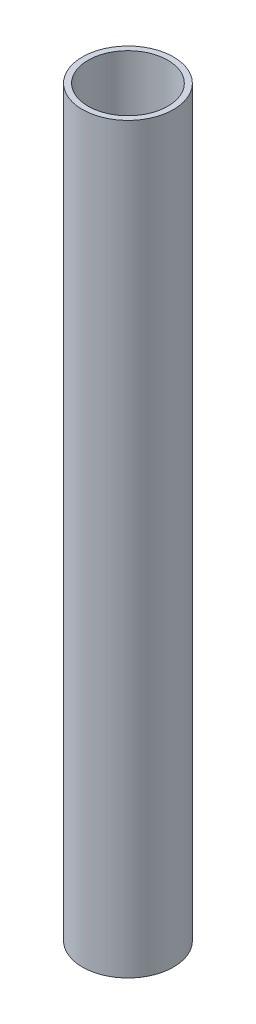
ISO-10303-21;
HEADER;
FILE_DESCRIPTION(('STEP AP214'),'2;1');
FILE_NAME('part.step','',(''),(''),'','','');
FILE_SCHEMA(('AUTOMOTIVE_DESIGN { 1 0 10303 214 1 1 1 1 }'));
ENDSEC;
DATA;
#1=APPLICATION_CONTEXT('core data for automotive mechanical design processes');
#2=APPLICATION_PROTOCOL_DEFINITION('international standard','automotive_design',2000,#1);
#3=PRODUCT_CONTEXT('',#1,'mechanical');
#4=PRODUCT('Part','Part','',(#3));
#5=PRODUCT_RELATED_PRODUCT_CATEGORY('part','',(#4));
#6=PRODUCT_DEFINITION_FORMATION('','',#4);
#7=PRODUCT_DEFINITION_CONTEXT('part definition',#1,'design');
#8=PRODUCT_DEFINITION('design','',#6,#7);
#9=PRODUCT_DEFINITION_SHAPE('','',#8);
#10=(LENGTH_UNIT() NAMED_UNIT(*) SI_UNIT(.MILLI.,.METRE.));
#11=(NAMED_UNIT(*) PLANE_ANGLE_UNIT() SI_UNIT($,.RADIAN.));
#12=(NAMED_UNIT(*) SI_UNIT($,.STERADIAN.) SOLID_ANGLE_UNIT());
#13=UNCERTAINTY_MEASURE_WITH_UNIT(LENGTH_MEASURE(1.E-05),#10,'distance_accuracy_value','');
#14=(GEOMETRIC_REPRESENTATION_CONTEXT(3) GLOBAL_UNCERTAINTY_ASSIGNED_CONTEXT((#13)) GLOBAL_UNIT_ASSIGNED_CONTEXT((#10,
#11,#12)) REPRESENTATION_CONTEXT('',''));
#15=CARTESIAN_POINT('',(0.,0.,0.));
#16=DIRECTION('',(0.,0.,1.));
#17=DIRECTION('',(1.,0.,0.));
#18=AXIS2_PLACEMENT_3D('',#15,#16,#17);
#19=CARTESIAN_POINT('',(0.,65.19,0.));
#20=DIRECTION('',(0.,1.,0.));
#21=DIRECTION('',(0.,0.,1.));
#22=AXIS2_PLACEMENT_3D('',#19,#20,#21);
#23=PLANE('',#22);
#24=CARTESIAN_POINT('',(0.,65.19,0.));
#25=DIRECTION('',(0.,1.,0.));
#26=DIRECTION('',(0.,0.,1.));
#27=AXIS2_PLACEMENT_3D('',#24,#25,#26);
#28=CIRCLE('',#27,4.);
#29=CARTESIAN_POINT('',(0.,65.19,4.));
#30=VERTEX_POINT('',#29);
#31=EDGE_CURVE('E10',#30,#30,#28,.T.);
#32=ORIENTED_EDGE('',*,*,#31,.T.);
#33=EDGE_LOOP('',(#32));
#34=FACE_BOUND('',#33,.T.);
#35=CARTESIAN_POINT('',(0.,65.19,0.));
#36=DIRECTION('',(0.,1.,0.));
#37=DIRECTION('',(0.,0.,1.));
#38=AXIS2_PLACEMENT_3D('',#35,#36,#37);
#39=CIRCLE('',#38,3.5);
#40=CARTESIAN_POINT('',(0.,65.19,3.5));
#41=VERTEX_POINT('',#40);
#42=EDGE_CURVE('E44',#41,#41,#39,.T.);
#43=ORIENTED_EDGE('',*,*,#42,.F.);
#44=EDGE_LOOP('',(#43));
#45=FACE_BOUND('',#44,.T.);
#46=ADVANCED_FACE('F33',(#34,#45),#23,.T.);
#47=CARTESIAN_POINT('',(0.,0.,0.));
#48=DIRECTION('',(0.,1.,0.));
#49=DIRECTION('',(0.,0.,1.));
#50=AXIS2_PLACEMENT_3D('',#47,#48,#49);
#51=PLANE('',#50);
#52=CARTESIAN_POINT('',(0.,0.,0.));
#53=DIRECTION('',(0.,1.,0.));
#54=DIRECTION('',(0.,0.,1.));
#55=AXIS2_PLACEMENT_3D('',#52,#53,#54);
#56=CIRCLE('',#55,4.);
#57=CARTESIAN_POINT('',(0.,0.,4.));
#58=VERTEX_POINT('',#57);
#59=EDGE_CURVE('E37',#58,#58,#56,.T.);
#60=ORIENTED_EDGE('',*,*,#59,.F.);
#61=EDGE_LOOP('',(#60));
#62=FACE_BOUND('',#61,.T.);
#63=CARTESIAN_POINT('',(0.,0.,0.));
#64=DIRECTION('',(0.,1.,0.));
#65=DIRECTION('',(0.,0.,1.));
#66=AXIS2_PLACEMENT_3D('',#63,#64,#65);
#67=CIRCLE('',#66,3.5);
#68=CARTESIAN_POINT('',(0.,0.,3.5));
#69=VERTEX_POINT('',#68);
#70=EDGE_CURVE('E46',#69,#69,#67,.T.);
#71=ORIENTED_EDGE('',*,*,#70,.T.);
#72=EDGE_LOOP('',(#71));
#73=FACE_BOUND('',#72,.T.);
#74=ADVANCED_FACE('F56',(#62,#73),#51,.F.);
#75=CARTESIAN_POINT('',(0.,65.19,0.));
#76=DIRECTION('',(0.,-1.,0.));
#77=DIRECTION('',(0.,0.,-1.));
#78=AXIS2_PLACEMENT_3D('',#75,#76,#77);
#79=CYLINDRICAL_SURFACE('',#78,4.);
#80=ORIENTED_EDGE('',*,*,#31,.F.);
#81=EDGE_LOOP('',(#80));
#82=FACE_BOUND('',#81,.T.);
#83=ORIENTED_EDGE('',*,*,#59,.T.);
#84=EDGE_LOOP('',(#83));
#85=FACE_BOUND('',#84,.T.);
#86=ADVANCED_FACE('F35',(#82,#85),#79,.T.);
#87=CARTESIAN_POINT('',(0.,65.19,0.));
#88=DIRECTION('',(0.,-1.,0.));
#89=DIRECTION('',(0.,0.,-1.));
#90=AXIS2_PLACEMENT_3D('',#87,#88,#89);
#91=CYLINDRICAL_SURFACE('',#90,3.5);
#92=ORIENTED_EDGE('',*,*,#42,.T.);
#93=EDGE_LOOP('',(#92));
#94=FACE_BOUND('',#93,.T.);
#95=ORIENTED_EDGE('',*,*,#70,.F.);
#96=EDGE_LOOP('',(#95));
#97=FACE_BOUND('',#96,.T.);
#98=ADVANCED_FACE('F52',(#94,#97),#91,.F.);
#99=CLOSED_SHELL('',(#46,#74,#86,#98));
#100=MANIFOLD_SOLID_BREP('B2',#99);
#101=ADVANCED_BREP_SHAPE_REPRESENTATION('',(#18,#100),#14);
#102=SHAPE_DEFINITION_REPRESENTATION(#9,#101);
ENDSEC;
END-ISO-10303-21;
